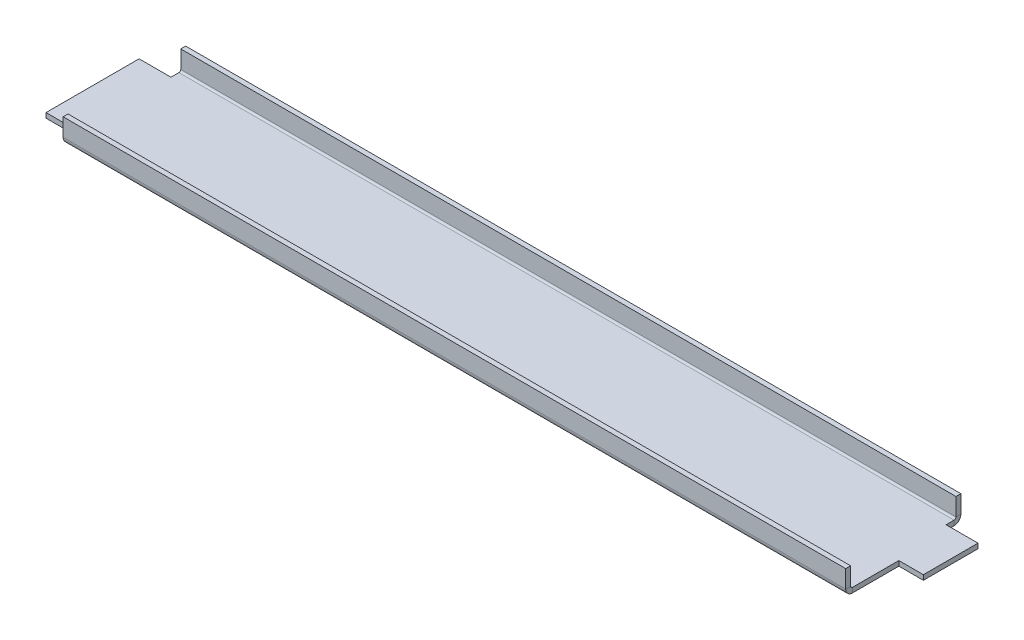
ISO-10303-21;
HEADER;
FILE_DESCRIPTION(('STEP AP214'),'2;1');
FILE_NAME('part.step','',(''),(''),'','','');
FILE_SCHEMA(('AUTOMOTIVE_DESIGN { 1 0 10303 214 1 1 1 1 }'));
ENDSEC;
DATA;
#1=APPLICATION_CONTEXT('core data for automotive mechanical design processes');
#2=APPLICATION_PROTOCOL_DEFINITION('international standard','automotive_design',2000,#1);
#3=PRODUCT_CONTEXT('',#1,'mechanical');
#4=PRODUCT('Part','Part','',(#3));
#5=PRODUCT_RELATED_PRODUCT_CATEGORY('part','',(#4));
#6=PRODUCT_DEFINITION_FORMATION('','',#4);
#7=PRODUCT_DEFINITION_CONTEXT('part definition',#1,'design');
#8=PRODUCT_DEFINITION('design','',#6,#7);
#9=PRODUCT_DEFINITION_SHAPE('','',#8);
#10=(LENGTH_UNIT() NAMED_UNIT(*) SI_UNIT(.MILLI.,.METRE.));
#11=(NAMED_UNIT(*) PLANE_ANGLE_UNIT() SI_UNIT($,.RADIAN.));
#12=(NAMED_UNIT(*) SI_UNIT($,.STERADIAN.) SOLID_ANGLE_UNIT());
#13=UNCERTAINTY_MEASURE_WITH_UNIT(LENGTH_MEASURE(1.E-05),#10,'distance_accuracy_value','');
#14=(GEOMETRIC_REPRESENTATION_CONTEXT(3) GLOBAL_UNCERTAINTY_ASSIGNED_CONTEXT((#13)) GLOBAL_UNIT_ASSIGNED_CONTEXT((#10,
#11,#12)) REPRESENTATION_CONTEXT('',''));
#15=CARTESIAN_POINT('',(0.,0.,0.));
#16=DIRECTION('',(0.,0.,1.));
#17=DIRECTION('',(1.,0.,0.));
#18=AXIS2_PLACEMENT_3D('',#15,#16,#17);
#19=CARTESIAN_POINT('',(161.2,0.,19.));
#20=DIRECTION('',(1.,0.,0.));
#21=DIRECTION('',(0.,0.,-1.));
#22=AXIS2_PLACEMENT_3D('',#19,#20,#21);
#23=PLANE('',#22);
#24=DIRECTION('',(0.,-1.,0.));
#25=VECTOR('',#24,1.);
#26=CARTESIAN_POINT('',(161.2,0.,25.));
#27=LINE('',#26,#25);
#28=CARTESIAN_POINT('',(161.2,10.,25.));
#29=VERTEX_POINT('',#28);
#30=CARTESIAN_POINT('',(161.2,2.7366,25.));
#31=VERTEX_POINT('',#30);
#32=EDGE_CURVE('E361',#29,#31,#27,.T.);
#33=ORIENTED_EDGE('',*,*,#32,.T.);
#34=DIRECTION('',(0.,0.,-1.));
#35=VECTOR('',#34,1.);
#36=CARTESIAN_POINT('',(161.2,2.7366,19.));
#37=LINE('',#36,#35);
#38=CARTESIAN_POINT('',(161.2,2.7366,23.));
#39=VERTEX_POINT('',#38);
#40=EDGE_CURVE('E14',#31,#39,#37,.T.);
#41=ORIENTED_EDGE('',*,*,#40,.T.);
#42=DIRECTION('',(0.,-1.,0.));
#43=VECTOR('',#42,1.);
#44=CARTESIAN_POINT('',(161.2,0.,23.));
#45=LINE('',#44,#43);
#46=CARTESIAN_POINT('',(161.2,10.,23.));
#47=VERTEX_POINT('',#46);
#48=EDGE_CURVE('E365',#47,#39,#45,.T.);
#49=ORIENTED_EDGE('',*,*,#48,.F.);
#50=DIRECTION('',(0.,0.,-1.));
#51=VECTOR('',#50,1.);
#52=CARTESIAN_POINT('',(161.2,10.,19.));
#53=LINE('',#52,#51);
#54=EDGE_CURVE('E366',#29,#47,#53,.T.);
#55=ORIENTED_EDGE('',*,*,#54,.F.);
#56=EDGE_LOOP('',(#33,#41,#49,#55));
#57=FACE_BOUND('',#56,.T.);
#58=ADVANCED_FACE('F105',(#57),#23,.T.);
#59=CARTESIAN_POINT('',(158.2,0.,-85.2858201534945));
#60=DIRECTION('',(1.,0.,0.));
#61=DIRECTION('',(0.,0.,-1.));
#62=AXIS2_PLACEMENT_3D('',#59,#60,#61);
#63=PLANE('',#62);
#64=DIRECTION('',(0.,0.,-1.));
#65=VECTOR('',#64,1.);
#66=CARTESIAN_POINT('',(158.2,0.,-85.2858201534945));
#67=LINE('',#66,#65);
#68=CARTESIAN_POINT('',(158.2,0.,-19.));
#69=VERTEX_POINT('',#68);
#70=CARTESIAN_POINT('',(158.2,0.,-22.2634));
#71=VERTEX_POINT('',#70);
#72=EDGE_CURVE('E370',#69,#71,#67,.T.);
#73=ORIENTED_EDGE('',*,*,#72,.T.);
#74=DIRECTION('',(0.,1.,0.));
#75=VECTOR('',#74,1.);
#76=CARTESIAN_POINT('',(158.2,0.,-22.2634));
#77=LINE('',#76,#75);
#78=CARTESIAN_POINT('',(158.2,1.99999999999999,-22.2634));
#79=VERTEX_POINT('',#78);
#80=EDGE_CURVE('E356',#71,#79,#77,.T.);
#81=ORIENTED_EDGE('',*,*,#80,.T.);
#82=DIRECTION('',(0.,0.,-1.));
#83=VECTOR('',#82,1.);
#84=CARTESIAN_POINT('',(158.2,2.,0.));
#85=LINE('',#84,#83);
#86=CARTESIAN_POINT('',(158.2,2.,-19.));
#87=VERTEX_POINT('',#86);
#88=EDGE_CURVE('E531',#87,#79,#85,.T.);
#89=ORIENTED_EDGE('',*,*,#88,.F.);
#90=DIRECTION('',(0.,1.,0.));
#91=VECTOR('',#90,1.);
#92=CARTESIAN_POINT('',(158.2,0.,-19.));
#93=LINE('',#92,#91);
#94=EDGE_CURVE('E544',#69,#87,#93,.T.);
#95=ORIENTED_EDGE('',*,*,#94,.F.);
#96=EDGE_LOOP('',(#73,#81,#89,#95));
#97=FACE_BOUND('',#96,.T.);
#98=ADVANCED_FACE('F553',(#97),#63,.T.);
#99=DIRECTION('',(0.,1.,0.));
#100=VECTOR('',#99,1.);
#101=CARTESIAN_POINT('',(158.2,0.,-23.));
#102=LINE('',#101,#100);
#103=CARTESIAN_POINT('',(158.2,2.73659999999999,-23.));
#104=VERTEX_POINT('',#103);
#105=CARTESIAN_POINT('',(158.2,10.0000000008471,-23.));
#106=VERTEX_POINT('',#105);
#107=EDGE_CURVE('E275',#104,#106,#102,.T.);
#108=ORIENTED_EDGE('',*,*,#107,.F.);
#109=DIRECTION('',(0.,0.,-1.));
#110=VECTOR('',#109,1.);
#111=CARTESIAN_POINT('',(158.2,2.73659999999999,-23.));
#112=LINE('',#111,#110);
#113=CARTESIAN_POINT('',(158.2,2.73659999999999,-25.));
#114=VERTEX_POINT('',#113);
#115=EDGE_CURVE('E353',#104,#114,#112,.T.);
#116=ORIENTED_EDGE('',*,*,#115,.T.);
#117=DIRECTION('',(0.,1.,0.));
#118=VECTOR('',#117,1.);
#119=CARTESIAN_POINT('',(158.2,0.,-25.));
#120=LINE('',#119,#118);
#121=CARTESIAN_POINT('',(158.2,10.,-25.));
#122=VERTEX_POINT('',#121);
#123=EDGE_CURVE('E124',#114,#122,#120,.T.);
#124=ORIENTED_EDGE('',*,*,#123,.T.);
#125=DIRECTION('',(0.,0.,1.));
#126=VECTOR('',#125,1.);
#127=CARTESIAN_POINT('',(158.2,10.,-25.));
#128=LINE('',#127,#126);
#129=EDGE_CURVE('E350',#122,#106,#128,.T.);
#130=ORIENTED_EDGE('',*,*,#129,.T.);
#131=EDGE_LOOP('',(#108,#116,#124,#130));
#132=FACE_BOUND('',#131,.T.);
#133=ADVANCED_FACE('F575',(#132),#63,.T.);
#134=CARTESIAN_POINT('',(161.2,0.,0.));
#135=DIRECTION('',(1.,0.,0.));
#136=DIRECTION('',(0.,0.,-1.));
#137=AXIS2_PLACEMENT_3D('',#134,#135,#136);
#138=PLANE('',#137);
#139=DIRECTION('',(0.,0.,-1.));
#140=VECTOR('',#139,1.);
#141=CARTESIAN_POINT('',(161.2,2.,0.));
#142=LINE('',#141,#140);
#143=CARTESIAN_POINT('',(161.2,2.,22.2634));
#144=VERTEX_POINT('',#143);
#145=CARTESIAN_POINT('',(161.2,2.,3.30000000012952));
#146=VERTEX_POINT('',#145);
#147=EDGE_CURVE('E468',#144,#146,#142,.T.);
#148=ORIENTED_EDGE('',*,*,#147,.F.);
#149=DIRECTION('',(0.,1.,0.));
#150=VECTOR('',#149,1.);
#151=CARTESIAN_POINT('',(161.2,0.,22.2634));
#152=LINE('',#151,#150);
#153=CARTESIAN_POINT('',(161.2,0.,22.2634));
#154=VERTEX_POINT('',#153);
#155=EDGE_CURVE('E115',#144,#154,#152,.F.);
#156=ORIENTED_EDGE('',*,*,#155,.T.);
#157=DIRECTION('',(0.,0.,-1.));
#158=VECTOR('',#157,1.);
#159=CARTESIAN_POINT('',(161.2,0.,0.));
#160=LINE('',#159,#158);
#161=CARTESIAN_POINT('',(161.2,0.,3.30000000012952));
#162=VERTEX_POINT('',#161);
#163=EDGE_CURVE('E151',#154,#162,#160,.T.);
#164=ORIENTED_EDGE('',*,*,#163,.T.);
#165=DIRECTION('',(0.,-1.,0.));
#166=VECTOR('',#165,1.);
#167=CARTESIAN_POINT('',(161.2,0.,3.30000000012952));
#168=LINE('',#167,#166);
#169=EDGE_CURVE('E463',#146,#162,#168,.T.);
#170=ORIENTED_EDGE('',*,*,#169,.F.);
#171=EDGE_LOOP('',(#148,#156,#164,#170));
#172=FACE_BOUND('',#171,.T.);
#173=ADVANCED_FACE('F484',(#172),#138,.T.);
#174=CARTESIAN_POINT('',(171.2,2.7366,22.2634));
#175=DIRECTION('',(1.,0.,0.));
#176=DIRECTION('',(0.,0.,1.));
#177=AXIS2_PLACEMENT_3D('',#174,#175,#176);
#178=CYLINDRICAL_SURFACE('',#177,2.7366);
#179=DIRECTION('',(1.,0.,0.));
#180=VECTOR('',#179,1.);
#181=CARTESIAN_POINT('',(171.2,0.,22.2634));
#182=LINE('',#181,#180);
#183=CARTESIAN_POINT('',(-158.2,0.,22.2634));
#184=VERTEX_POINT('',#183);
#185=EDGE_CURVE('E314',#154,#184,#182,.F.);
#186=ORIENTED_EDGE('',*,*,#185,.F.);
#187=CARTESIAN_POINT('',(161.2,2.7366,22.2634));
#188=DIRECTION('',(1.,0.,0.));
#189=DIRECTION('',(0.,0.,-1.));
#190=AXIS2_PLACEMENT_3D('',#187,#188,#189);
#191=CIRCLE('',#190,2.7366);
#192=EDGE_CURVE('E108',#154,#31,#191,.F.);
#193=ORIENTED_EDGE('',*,*,#192,.T.);
#194=DIRECTION('',(1.,0.,0.));
#195=VECTOR('',#194,1.);
#196=CARTESIAN_POINT('',(-171.2,2.7366,25.));
#197=LINE('',#196,#195);
#198=CARTESIAN_POINT('',(-158.2,2.7366,25.));
#199=VERTEX_POINT('',#198);
#200=EDGE_CURVE('E308',#31,#199,#197,.F.);
#201=ORIENTED_EDGE('',*,*,#200,.T.);
#202=CARTESIAN_POINT('',(-158.2,2.7366,22.2634));
#203=DIRECTION('',(1.,0.,0.));
#204=DIRECTION('',(0.,0.,-1.));
#205=AXIS2_PLACEMENT_3D('',#202,#203,#204);
#206=CIRCLE('',#205,2.7366);
#207=EDGE_CURVE('E445',#184,#199,#206,.F.);
#208=ORIENTED_EDGE('',*,*,#207,.F.);
#209=EDGE_LOOP('',(#186,#193,#201,#208));
#210=FACE_BOUND('',#209,.T.);
#211=ADVANCED_FACE('F493',(#210),#178,.T.);
#212=CARTESIAN_POINT('',(171.2,2.7366,22.2634));
#213=DIRECTION('',(1.,0.,0.));
#214=DIRECTION('',(0.,0.,1.));
#215=AXIS2_PLACEMENT_3D('',#212,#213,#214);
#216=CYLINDRICAL_SURFACE('',#215,0.7366);
#217=CARTESIAN_POINT('',(161.2,2.7366,22.2634));
#218=DIRECTION('',(1.,0.,0.));
#219=DIRECTION('',(0.,0.,-1.));
#220=AXIS2_PLACEMENT_3D('',#217,#218,#219);
#221=CIRCLE('',#220,0.7366);
#222=EDGE_CURVE('E373',#144,#39,#221,.F.);
#223=ORIENTED_EDGE('',*,*,#222,.F.);
#224=DIRECTION('',(1.,0.,0.));
#225=VECTOR('',#224,1.);
#226=CARTESIAN_POINT('',(171.2,2.,22.2634));
#227=LINE('',#226,#225);
#228=CARTESIAN_POINT('',(-158.2,2.,22.2634));
#229=VERTEX_POINT('',#228);
#230=EDGE_CURVE('E304',#144,#229,#227,.F.);
#231=ORIENTED_EDGE('',*,*,#230,.T.);
#232=CARTESIAN_POINT('',(-158.2,2.7366,22.2634));
#233=DIRECTION('',(1.,0.,0.));
#234=DIRECTION('',(0.,0.,-1.));
#235=AXIS2_PLACEMENT_3D('',#232,#233,#234);
#236=CIRCLE('',#235,0.7366);
#237=CARTESIAN_POINT('',(-158.2,2.7366,23.));
#238=VERTEX_POINT('',#237);
#239=EDGE_CURVE('E433',#229,#238,#236,.F.);
#240=ORIENTED_EDGE('',*,*,#239,.T.);
#241=DIRECTION('',(1.,0.,0.));
#242=VECTOR('',#241,1.);
#243=CARTESIAN_POINT('',(-171.2,2.7366,23.));
#244=LINE('',#243,#242);
#245=EDGE_CURVE('E297',#238,#39,#244,.T.);
#246=ORIENTED_EDGE('',*,*,#245,.T.);
#247=EDGE_LOOP('',(#223,#231,#240,#246));
#248=FACE_BOUND('',#247,.T.);
#249=ADVANCED_FACE('F617',(#248),#216,.F.);
#250=CARTESIAN_POINT('',(0.,0.,25.));
#251=DIRECTION('',(0.,0.,-1.));
#252=DIRECTION('',(-1.,0.,0.));
#253=AXIS2_PLACEMENT_3D('',#250,#251,#252);
#254=PLANE('',#253);
#255=ORIENTED_EDGE('',*,*,#32,.F.);
#256=DIRECTION('',(-1.,0.,0.));
#257=VECTOR('',#256,1.);
#258=CARTESIAN_POINT('',(0.,10.,25.));
#259=LINE('',#258,#257);
#260=CARTESIAN_POINT('',(-158.2,10.0000000008471,25.));
#261=VERTEX_POINT('',#260);
#262=EDGE_CURVE('E301',#29,#261,#259,.T.);
#263=ORIENTED_EDGE('',*,*,#262,.T.);
#264=DIRECTION('',(0.,-1.,0.));
#265=VECTOR('',#264,1.);
#266=CARTESIAN_POINT('',(-158.2,0.,25.));
#267=LINE('',#266,#265);
#268=EDGE_CURVE('E441',#261,#199,#267,.T.);
#269=ORIENTED_EDGE('',*,*,#268,.T.);
#270=ORIENTED_EDGE('',*,*,#200,.F.);
#271=EDGE_LOOP('',(#255,#263,#269,#270));
#272=FACE_BOUND('',#271,.T.);
#273=ADVANCED_FACE('F624',(#272),#254,.F.);
#274=CARTESIAN_POINT('',(0.,0.,23.));
#275=DIRECTION('',(0.,0.,-1.));
#276=DIRECTION('',(-1.,0.,0.));
#277=AXIS2_PLACEMENT_3D('',#274,#275,#276);
#278=PLANE('',#277);
#279=DIRECTION('',(1.,0.,0.));
#280=VECTOR('',#279,1.);
#281=CARTESIAN_POINT('',(-171.2,10.,23.));
#282=LINE('',#281,#280);
#283=CARTESIAN_POINT('',(-158.2,10.0000000008471,23.));
#284=VERTEX_POINT('',#283);
#285=EDGE_CURVE('E305',#47,#284,#282,.F.);
#286=ORIENTED_EDGE('',*,*,#285,.F.);
#287=ORIENTED_EDGE('',*,*,#48,.T.);
#288=ORIENTED_EDGE('',*,*,#245,.F.);
#289=DIRECTION('',(0.,-1.,0.));
#290=VECTOR('',#289,1.);
#291=CARTESIAN_POINT('',(-158.2,0.,23.));
#292=LINE('',#291,#290);
#293=EDGE_CURVE('E437',#284,#238,#292,.T.);
#294=ORIENTED_EDGE('',*,*,#293,.F.);
#295=EDGE_LOOP('',(#286,#287,#288,#294));
#296=FACE_BOUND('',#295,.T.);
#297=ADVANCED_FACE('F618',(#296),#278,.T.);
#298=CARTESIAN_POINT('',(-171.2,10.,25.));
#299=DIRECTION('',(0.,-1.,0.));
#300=DIRECTION('',(0.,0.,-1.));
#301=AXIS2_PLACEMENT_3D('',#298,#299,#300);
#302=PLANE('',#301);
#303=ORIENTED_EDGE('',*,*,#54,.T.);
#304=ORIENTED_EDGE('',*,*,#285,.T.);
#305=DIRECTION('',(0.,0.,-1.));
#306=VECTOR('',#305,1.);
#307=CARTESIAN_POINT('',(-158.2,10.0000000008471,19.));
#308=LINE('',#307,#306);
#309=EDGE_CURVE('E391',#261,#284,#308,.T.);
#310=ORIENTED_EDGE('',*,*,#309,.F.);
#311=ORIENTED_EDGE('',*,*,#262,.F.);
#312=EDGE_LOOP('',(#303,#304,#310,#311));
#313=FACE_BOUND('',#312,.T.);
#314=ADVANCED_FACE('F622',(#313),#302,.F.);
#315=CARTESIAN_POINT('',(171.2,2.,-25.));
#316=DIRECTION('',(-1.,0.,0.));
#317=DIRECTION('',(0.,0.,1.));
#318=AXIS2_PLACEMENT_3D('',#315,#316,#317);
#319=PLANE('',#318);
#320=DIRECTION('',(0.,-1.,0.));
#321=VECTOR('',#320,1.);
#322=CARTESIAN_POINT('',(171.2,2.,-19.));
#323=LINE('',#322,#321);
#324=CARTESIAN_POINT('',(171.2,2.,-19.));
#325=VERTEX_POINT('',#324);
#326=CARTESIAN_POINT('',(171.2,0.,-19.));
#327=VERTEX_POINT('',#326);
#328=EDGE_CURVE('E376',#325,#327,#323,.T.);
#329=ORIENTED_EDGE('',*,*,#328,.F.);
#330=DIRECTION('',(0.,0.,-1.));
#331=VECTOR('',#330,1.);
#332=CARTESIAN_POINT('',(171.2,2.,-25.));
#333=LINE('',#332,#331);
#334=CARTESIAN_POINT('',(171.2,2.,3.30000000012952));
#335=VERTEX_POINT('',#334);
#336=EDGE_CURVE('E320',#335,#325,#333,.T.);
#337=ORIENTED_EDGE('',*,*,#336,.F.);
#338=DIRECTION('',(0.,-1.,0.));
#339=VECTOR('',#338,1.);
#340=CARTESIAN_POINT('',(171.2,0.,3.30000000012952));
#341=LINE('',#340,#339);
#342=CARTESIAN_POINT('',(171.2,0.,3.30000000012952));
#343=VERTEX_POINT('',#342);
#344=EDGE_CURVE('E464',#335,#343,#341,.T.);
#345=ORIENTED_EDGE('',*,*,#344,.T.);
#346=DIRECTION('',(0.,0.,-1.));
#347=VECTOR('',#346,1.);
#348=CARTESIAN_POINT('',(171.2,0.,-25.));
#349=LINE('',#348,#347);
#350=EDGE_CURVE('E317',#343,#327,#349,.T.);
#351=ORIENTED_EDGE('',*,*,#350,.T.);
#352=EDGE_LOOP('',(#329,#337,#345,#351));
#353=FACE_BOUND('',#352,.T.);
#354=ADVANCED_FACE('F635',(#353),#319,.F.);
#355=CARTESIAN_POINT('',(0.,2.,0.));
#356=DIRECTION('',(0.,1.,0.));
#357=DIRECTION('',(0.,0.,1.));
#358=AXIS2_PLACEMENT_3D('',#355,#356,#357);
#359=PLANE('',#358);
#360=ORIENTED_EDGE('',*,*,#230,.F.);
#361=ORIENTED_EDGE('',*,*,#147,.T.);
#362=DIRECTION('',(-1.,0.,0.));
#363=VECTOR('',#362,1.);
#364=CARTESIAN_POINT('',(0.,2.,3.30000000012952));
#365=LINE('',#364,#363);
#366=EDGE_CURVE('E292',#335,#146,#365,.T.);
#367=ORIENTED_EDGE('',*,*,#366,.F.);
#368=ORIENTED_EDGE('',*,*,#336,.T.);
#369=DIRECTION('',(-1.,0.,0.));
#370=VECTOR('',#369,1.);
#371=CARTESIAN_POINT('',(0.,2.,-19.0000000000001));
#372=LINE('',#371,#370);
#373=EDGE_CURVE('E382',#325,#87,#372,.T.);
#374=ORIENTED_EDGE('',*,*,#373,.T.);
#375=ORIENTED_EDGE('',*,*,#88,.T.);
#376=DIRECTION('',(-1.,0.,0.));
#377=VECTOR('',#376,1.);
#378=CARTESIAN_POINT('',(-171.2,1.99999999999999,-22.2634));
#379=LINE('',#378,#377);
#380=CARTESIAN_POINT('',(-158.2,1.99999999999999,-22.2634));
#381=VERTEX_POINT('',#380);
#382=EDGE_CURVE('E282',#381,#79,#379,.F.);
#383=ORIENTED_EDGE('',*,*,#382,.F.);
#384=DIRECTION('',(0.,0.,-1.));
#385=VECTOR('',#384,1.);
#386=CARTESIAN_POINT('',(-158.2,2.,0.));
#387=LINE('',#386,#385);
#388=CARTESIAN_POINT('',(-158.2,2.,-19.));
#389=VERTEX_POINT('',#388);
#390=EDGE_CURVE('E420',#389,#381,#387,.T.);
#391=ORIENTED_EDGE('',*,*,#390,.F.);
#392=DIRECTION('',(1.,0.,0.));
#393=VECTOR('',#392,1.);
#394=CARTESIAN_POINT('',(0.,2.,-19.0000000000001));
#395=LINE('',#394,#393);
#396=CARTESIAN_POINT('',(-171.2,2.,-19.));
#397=VERTEX_POINT('',#396);
#398=EDGE_CURVE('E456',#397,#389,#395,.T.);
#399=ORIENTED_EDGE('',*,*,#398,.F.);
#400=DIRECTION('',(0.,0.,1.));
#401=VECTOR('',#400,1.);
#402=CARTESIAN_POINT('',(-171.2,2.,-25.));
#403=LINE('',#402,#401);
#404=CARTESIAN_POINT('',(-171.2,2.,19.));
#405=VERTEX_POINT('',#404);
#406=EDGE_CURVE('E324',#397,#405,#403,.T.);
#407=ORIENTED_EDGE('',*,*,#406,.T.);
#408=DIRECTION('',(-1.,0.,0.));
#409=VECTOR('',#408,1.);
#410=CARTESIAN_POINT('',(0.,2.,19.));
#411=LINE('',#410,#409);
#412=CARTESIAN_POINT('',(-158.2,2.,19.));
#413=VERTEX_POINT('',#412);
#414=EDGE_CURVE('E449',#413,#405,#411,.T.);
#415=ORIENTED_EDGE('',*,*,#414,.F.);
#416=DIRECTION('',(0.,0.,-1.));
#417=VECTOR('',#416,1.);
#418=CARTESIAN_POINT('',(-158.2,2.,0.));
#419=LINE('',#418,#417);
#420=EDGE_CURVE('E430',#229,#413,#419,.T.);
#421=ORIENTED_EDGE('',*,*,#420,.F.);
#422=EDGE_LOOP('',(#360,#361,#367,#368,#374,#375,#383,#391,#399,#407,#415,#421));
#423=FACE_BOUND('',#422,.T.);
#424=ADVANCED_FACE('F508',(#423),#359,.T.);
#425=CARTESIAN_POINT('',(0.,0.,0.));
#426=DIRECTION('',(0.,1.,0.));
#427=DIRECTION('',(0.,0.,1.));
#428=AXIS2_PLACEMENT_3D('',#425,#426,#427);
#429=PLANE('',#428);
#430=ORIENTED_EDGE('',*,*,#163,.F.);
#431=ORIENTED_EDGE('',*,*,#185,.T.);
#432=DIRECTION('',(0.,0.,-1.));
#433=VECTOR('',#432,1.);
#434=CARTESIAN_POINT('',(-158.2,0.,19.));
#435=LINE('',#434,#433);
#436=CARTESIAN_POINT('',(-158.2,0.,19.));
#437=VERTEX_POINT('',#436);
#438=EDGE_CURVE('E395',#184,#437,#435,.T.);
#439=ORIENTED_EDGE('',*,*,#438,.T.);
#440=DIRECTION('',(-1.,0.,0.));
#441=VECTOR('',#440,1.);
#442=CARTESIAN_POINT('',(-158.2,0.,19.));
#443=LINE('',#442,#441);
#444=CARTESIAN_POINT('',(-171.2,0.,19.));
#445=VERTEX_POINT('',#444);
#446=EDGE_CURVE('E399',#437,#445,#443,.T.);
#447=ORIENTED_EDGE('',*,*,#446,.T.);
#448=DIRECTION('',(0.,0.,1.));
#449=VECTOR('',#448,1.);
#450=CARTESIAN_POINT('',(-171.2,0.,-25.));
#451=LINE('',#450,#449);
#452=CARTESIAN_POINT('',(-171.2,0.,-19.));
#453=VERTEX_POINT('',#452);
#454=EDGE_CURVE('E325',#453,#445,#451,.T.);
#455=ORIENTED_EDGE('',*,*,#454,.F.);
#456=DIRECTION('',(1.,0.,0.));
#457=VECTOR('',#456,1.);
#458=CARTESIAN_POINT('',(-158.2,0.,-19.));
#459=LINE('',#458,#457);
#460=CARTESIAN_POINT('',(-158.2,0.,-19.));
#461=VERTEX_POINT('',#460);
#462=EDGE_CURVE('E403',#453,#461,#459,.T.);
#463=ORIENTED_EDGE('',*,*,#462,.T.);
#464=DIRECTION('',(0.,0.,-1.));
#465=VECTOR('',#464,1.);
#466=CARTESIAN_POINT('',(-158.2,0.,-85.2858201534945));
#467=LINE('',#466,#465);
#468=CARTESIAN_POINT('',(-158.2,0.,-22.2634));
#469=VERTEX_POINT('',#468);
#470=EDGE_CURVE('E407',#461,#469,#467,.T.);
#471=ORIENTED_EDGE('',*,*,#470,.T.);
#472=DIRECTION('',(-1.,0.,0.));
#473=VECTOR('',#472,1.);
#474=CARTESIAN_POINT('',(-171.2,0.,-22.2634));
#475=LINE('',#474,#473);
#476=EDGE_CURVE('E293',#469,#71,#475,.F.);
#477=ORIENTED_EDGE('',*,*,#476,.T.);
#478=ORIENTED_EDGE('',*,*,#72,.F.);
#479=DIRECTION('',(-1.,0.,0.));
#480=VECTOR('',#479,1.);
#481=CARTESIAN_POINT('',(158.2,0.,-19.));
#482=LINE('',#481,#480);
#483=EDGE_CURVE('E161',#327,#69,#482,.T.);
#484=ORIENTED_EDGE('',*,*,#483,.F.);
#485=ORIENTED_EDGE('',*,*,#350,.F.);
#486=DIRECTION('',(-1.,0.,0.));
#487=VECTOR('',#486,1.);
#488=CARTESIAN_POINT('',(0.,0.,3.30000000012952));
#489=LINE('',#488,#487);
#490=EDGE_CURVE('E270',#343,#162,#489,.T.);
#491=ORIENTED_EDGE('',*,*,#490,.T.);
#492=EDGE_LOOP('',(#430,#431,#439,#447,#455,#463,#471,#477,#478,#484,#485,#491));
#493=FACE_BOUND('',#492,.T.);
#494=ADVANCED_FACE('F495',(#493),#429,.F.);
#495=CARTESIAN_POINT('',(-171.2,2.7366,-22.2634));
#496=DIRECTION('',(-1.,0.,0.));
#497=DIRECTION('',(0.,0.,-1.));
#498=AXIS2_PLACEMENT_3D('',#495,#496,#497);
#499=CYLINDRICAL_SURFACE('',#498,2.7366);
#500=DIRECTION('',(-1.,0.,0.));
#501=VECTOR('',#500,1.);
#502=CARTESIAN_POINT('',(171.2,2.73660000000001,-25.));
#503=LINE('',#502,#501);
#504=CARTESIAN_POINT('',(-158.2,2.73659999999999,-25.));
#505=VERTEX_POINT('',#504);
#506=EDGE_CURVE('E277',#505,#114,#503,.F.);
#507=ORIENTED_EDGE('',*,*,#506,.T.);
#508=CARTESIAN_POINT('',(158.2,2.7366,-22.2634));
#509=DIRECTION('',(1.,0.,0.));
#510=DIRECTION('',(0.,0.,-1.));
#511=AXIS2_PLACEMENT_3D('',#508,#509,#510);
#512=CIRCLE('',#511,2.7366);
#513=EDGE_CURVE('E387',#114,#71,#512,.F.);
#514=ORIENTED_EDGE('',*,*,#513,.T.);
#515=ORIENTED_EDGE('',*,*,#476,.F.);
#516=CARTESIAN_POINT('',(-158.2,2.7366,-22.2634));
#517=DIRECTION('',(1.,0.,0.));
#518=DIRECTION('',(0.,0.,-1.));
#519=AXIS2_PLACEMENT_3D('',#516,#517,#518);
#520=CIRCLE('',#519,2.7366);
#521=EDGE_CURVE('E426',#505,#469,#520,.F.);
#522=ORIENTED_EDGE('',*,*,#521,.F.);
#523=EDGE_LOOP('',(#507,#514,#515,#522));
#524=FACE_BOUND('',#523,.T.);
#525=ADVANCED_FACE('F526',(#524),#499,.T.);
#526=CARTESIAN_POINT('',(-171.2,2.7366,-22.2634));
#527=DIRECTION('',(-1.,0.,0.));
#528=DIRECTION('',(0.,0.,-1.));
#529=AXIS2_PLACEMENT_3D('',#526,#527,#528);
#530=CYLINDRICAL_SURFACE('',#529,0.7366);
#531=CARTESIAN_POINT('',(158.2,2.7366,-22.2634));
#532=DIRECTION('',(1.,0.,0.));
#533=DIRECTION('',(0.,0.,-1.));
#534=AXIS2_PLACEMENT_3D('',#531,#532,#533);
#535=CIRCLE('',#534,0.7366);
#536=EDGE_CURVE('E536',#104,#79,#535,.F.);
#537=ORIENTED_EDGE('',*,*,#536,.F.);
#538=DIRECTION('',(-1.,0.,0.));
#539=VECTOR('',#538,1.);
#540=CARTESIAN_POINT('',(171.2,2.7366,-23.));
#541=LINE('',#540,#539);
#542=CARTESIAN_POINT('',(-158.2,2.73659999999999,-23.));
#543=VERTEX_POINT('',#542);
#544=EDGE_CURVE('E286',#104,#543,#541,.T.);
#545=ORIENTED_EDGE('',*,*,#544,.T.);
#546=CARTESIAN_POINT('',(-158.2,2.7366,-22.2634));
#547=DIRECTION('',(1.,0.,0.));
#548=DIRECTION('',(0.,0.,-1.));
#549=AXIS2_PLACEMENT_3D('',#546,#547,#548);
#550=CIRCLE('',#549,0.7366);
#551=EDGE_CURVE('E259',#543,#381,#550,.F.);
#552=ORIENTED_EDGE('',*,*,#551,.T.);
#553=ORIENTED_EDGE('',*,*,#382,.T.);
#554=EDGE_LOOP('',(#537,#545,#552,#553));
#555=FACE_BOUND('',#554,.T.);
#556=ADVANCED_FACE('F560',(#555),#530,.F.);
#557=CARTESIAN_POINT('',(0.,0.,-25.));
#558=DIRECTION('',(0.,0.,1.));
#559=DIRECTION('',(0.,-1.,0.));
#560=AXIS2_PLACEMENT_3D('',#557,#558,#559);
#561=PLANE('',#560);
#562=ORIENTED_EDGE('',*,*,#123,.F.);
#563=ORIENTED_EDGE('',*,*,#506,.F.);
#564=DIRECTION('',(0.,1.,0.));
#565=VECTOR('',#564,1.);
#566=CARTESIAN_POINT('',(-158.2,0.,-25.));
#567=LINE('',#566,#565);
#568=CARTESIAN_POINT('',(-158.2,10.0000000008471,-25.));
#569=VERTEX_POINT('',#568);
#570=EDGE_CURVE('E423',#505,#569,#567,.T.);
#571=ORIENTED_EDGE('',*,*,#570,.T.);
#572=DIRECTION('',(1.,0.,0.));
#573=VECTOR('',#572,1.);
#574=CARTESIAN_POINT('',(0.,10.,-25.));
#575=LINE('',#574,#573);
#576=EDGE_CURVE('E268',#569,#122,#575,.T.);
#577=ORIENTED_EDGE('',*,*,#576,.T.);
#578=EDGE_LOOP('',(#562,#563,#571,#577));
#579=FACE_BOUND('',#578,.T.);
#580=ADVANCED_FACE('F529',(#579),#561,.F.);
#581=CARTESIAN_POINT('',(0.,0.,-23.));
#582=DIRECTION('',(0.,0.,1.));
#583=DIRECTION('',(0.,-1.,0.));
#584=AXIS2_PLACEMENT_3D('',#581,#582,#583);
#585=PLANE('',#584);
#586=ORIENTED_EDGE('',*,*,#544,.F.);
#587=ORIENTED_EDGE('',*,*,#107,.T.);
#588=DIRECTION('',(-1.,0.,0.));
#589=VECTOR('',#588,1.);
#590=CARTESIAN_POINT('',(171.2,10.,-23.));
#591=LINE('',#590,#589);
#592=CARTESIAN_POINT('',(-158.2,10.,-23.));
#593=VERTEX_POINT('',#592);
#594=EDGE_CURVE('E266',#593,#106,#591,.F.);
#595=ORIENTED_EDGE('',*,*,#594,.F.);
#596=DIRECTION('',(0.,1.,0.));
#597=VECTOR('',#596,1.);
#598=CARTESIAN_POINT('',(-158.2,0.,-23.));
#599=LINE('',#598,#597);
#600=EDGE_CURVE('E247',#543,#593,#599,.T.);
#601=ORIENTED_EDGE('',*,*,#600,.F.);
#602=EDGE_LOOP('',(#586,#587,#595,#601));
#603=FACE_BOUND('',#602,.T.);
#604=ADVANCED_FACE('F273',(#603),#585,.T.);
#605=CARTESIAN_POINT('',(171.2,10.,-25.));
#606=DIRECTION('',(0.,-1.,0.));
#607=DIRECTION('',(0.,0.,-1.));
#608=AXIS2_PLACEMENT_3D('',#605,#606,#607);
#609=PLANE('',#608);
#610=ORIENTED_EDGE('',*,*,#129,.F.);
#611=ORIENTED_EDGE('',*,*,#576,.F.);
#612=DIRECTION('',(0.,0.,1.));
#613=VECTOR('',#612,1.);
#614=CARTESIAN_POINT('',(-158.2,10.,-25.));
#615=LINE('',#614,#613);
#616=EDGE_CURVE('E251',#569,#593,#615,.T.);
#617=ORIENTED_EDGE('',*,*,#616,.T.);
#618=ORIENTED_EDGE('',*,*,#594,.T.);
#619=EDGE_LOOP('',(#610,#611,#617,#618));
#620=FACE_BOUND('',#619,.T.);
#621=ADVANCED_FACE('F265',(#620),#609,.F.);
#622=CARTESIAN_POINT('',(-158.2,0.,19.));
#623=DIRECTION('',(1.,0.,0.));
#624=DIRECTION('',(0.,0.,-1.));
#625=AXIS2_PLACEMENT_3D('',#622,#623,#624);
#626=PLANE('',#625);
#627=ORIENTED_EDGE('',*,*,#293,.T.);
#628=DIRECTION('',(0.,0.,1.));
#629=VECTOR('',#628,1.);
#630=CARTESIAN_POINT('',(-158.2,2.7366,23.));
#631=LINE('',#630,#629);
#632=EDGE_CURVE('E346',#238,#199,#631,.T.);
#633=ORIENTED_EDGE('',*,*,#632,.T.);
#634=ORIENTED_EDGE('',*,*,#268,.F.);
#635=ORIENTED_EDGE('',*,*,#309,.T.);
#636=EDGE_LOOP('',(#627,#633,#634,#635));
#637=FACE_BOUND('',#636,.T.);
#638=ADVANCED_FACE('F595',(#637),#626,.F.);
#639=ORIENTED_EDGE('',*,*,#438,.F.);
#640=DIRECTION('',(0.,1.,0.));
#641=VECTOR('',#640,1.);
#642=CARTESIAN_POINT('',(-158.2,0.,22.2634));
#643=LINE('',#642,#641);
#644=EDGE_CURVE('E342',#184,#229,#643,.T.);
#645=ORIENTED_EDGE('',*,*,#644,.T.);
#646=ORIENTED_EDGE('',*,*,#420,.T.);
#647=DIRECTION('',(0.,1.,0.));
#648=VECTOR('',#647,1.);
#649=CARTESIAN_POINT('',(-158.2,0.,19.));
#650=LINE('',#649,#648);
#651=EDGE_CURVE('E411',#437,#413,#650,.T.);
#652=ORIENTED_EDGE('',*,*,#651,.F.);
#653=EDGE_LOOP('',(#639,#645,#646,#652));
#654=FACE_BOUND('',#653,.T.);
#655=ADVANCED_FACE('F503',(#654),#626,.F.);
#656=CARTESIAN_POINT('',(-158.2,0.,-85.2858201534945));
#657=DIRECTION('',(1.,0.,0.));
#658=DIRECTION('',(0.,0.,-1.));
#659=AXIS2_PLACEMENT_3D('',#656,#657,#658);
#660=PLANE('',#659);
#661=ORIENTED_EDGE('',*,*,#390,.T.);
#662=DIRECTION('',(0.,-1.,0.));
#663=VECTOR('',#662,1.);
#664=CARTESIAN_POINT('',(-158.2,1.99999999999999,-22.2634));
#665=LINE('',#664,#663);
#666=EDGE_CURVE('E339',#381,#469,#665,.T.);
#667=ORIENTED_EDGE('',*,*,#666,.T.);
#668=ORIENTED_EDGE('',*,*,#470,.F.);
#669=DIRECTION('',(0.,1.,0.));
#670=VECTOR('',#669,1.);
#671=CARTESIAN_POINT('',(-158.2,0.,-19.));
#672=LINE('',#671,#670);
#673=EDGE_CURVE('E260',#461,#389,#672,.T.);
#674=ORIENTED_EDGE('',*,*,#673,.T.);
#675=EDGE_LOOP('',(#661,#667,#668,#674));
#676=FACE_BOUND('',#675,.T.);
#677=ADVANCED_FACE('F520',(#676),#660,.F.);
#678=ORIENTED_EDGE('',*,*,#570,.F.);
#679=DIRECTION('',(0.,0.,1.));
#680=VECTOR('',#679,1.);
#681=CARTESIAN_POINT('',(-158.2,2.73659999999999,-25.));
#682=LINE('',#681,#680);
#683=EDGE_CURVE('E253',#505,#543,#682,.T.);
#684=ORIENTED_EDGE('',*,*,#683,.T.);
#685=ORIENTED_EDGE('',*,*,#600,.T.);
#686=ORIENTED_EDGE('',*,*,#616,.F.);
#687=EDGE_LOOP('',(#678,#684,#685,#686));
#688=FACE_BOUND('',#687,.T.);
#689=ADVANCED_FACE('F250',(#688),#660,.F.);
#690=CARTESIAN_POINT('',(-171.2,2.,-25.));
#691=DIRECTION('',(1.,0.,0.));
#692=DIRECTION('',(0.,0.,-1.));
#693=AXIS2_PLACEMENT_3D('',#690,#691,#692);
#694=PLANE('',#693);
#695=ORIENTED_EDGE('',*,*,#406,.F.);
#696=DIRECTION('',(0.,-1.,0.));
#697=VECTOR('',#696,1.);
#698=CARTESIAN_POINT('',(-171.2,2.,-19.));
#699=LINE('',#698,#697);
#700=EDGE_CURVE('E459',#397,#453,#699,.T.);
#701=ORIENTED_EDGE('',*,*,#700,.T.);
#702=ORIENTED_EDGE('',*,*,#454,.T.);
#703=DIRECTION('',(0.,1.,0.));
#704=VECTOR('',#703,1.);
#705=CARTESIAN_POINT('',(-171.2,2.,19.));
#706=LINE('',#705,#704);
#707=EDGE_CURVE('E452',#445,#405,#706,.T.);
#708=ORIENTED_EDGE('',*,*,#707,.T.);
#709=EDGE_LOOP('',(#695,#701,#702,#708));
#710=FACE_BOUND('',#709,.T.);
#711=ADVANCED_FACE('F513',(#710),#694,.F.);
#712=CARTESIAN_POINT('',(171.2,0.,3.30000000012952));
#713=DIRECTION('',(0.,0.,-1.));
#714=DIRECTION('',(-1.,0.,0.));
#715=AXIS2_PLACEMENT_3D('',#712,#713,#714);
#716=PLANE('',#715);
#717=ORIENTED_EDGE('',*,*,#366,.T.);
#718=ORIENTED_EDGE('',*,*,#169,.T.);
#719=ORIENTED_EDGE('',*,*,#490,.F.);
#720=ORIENTED_EDGE('',*,*,#344,.F.);
#721=EDGE_LOOP('',(#717,#718,#719,#720));
#722=FACE_BOUND('',#721,.T.);
#723=ADVANCED_FACE('F480',(#722),#716,.F.);
#724=ORIENTED_EDGE('',*,*,#666,.F.);
#725=ORIENTED_EDGE('',*,*,#551,.F.);
#726=ORIENTED_EDGE('',*,*,#683,.F.);
#727=ORIENTED_EDGE('',*,*,#521,.T.);
#728=EDGE_LOOP('',(#724,#725,#726,#727));
#729=FACE_BOUND('',#728,.T.);
#730=ADVANCED_FACE('F523',(#729),#660,.F.);
#731=CARTESIAN_POINT('',(-158.2,0.,-19.));
#732=DIRECTION('',(0.,0.,1.));
#733=DIRECTION('',(1.,0.,0.));
#734=AXIS2_PLACEMENT_3D('',#731,#732,#733);
#735=PLANE('',#734);
#736=ORIENTED_EDGE('',*,*,#398,.T.);
#737=ORIENTED_EDGE('',*,*,#673,.F.);
#738=ORIENTED_EDGE('',*,*,#462,.F.);
#739=ORIENTED_EDGE('',*,*,#700,.F.);
#740=EDGE_LOOP('',(#736,#737,#738,#739));
#741=FACE_BOUND('',#740,.T.);
#742=ADVANCED_FACE('F518',(#741),#735,.F.);
#743=CARTESIAN_POINT('',(-158.2,0.,19.));
#744=DIRECTION('',(0.,0.,-1.));
#745=DIRECTION('',(-1.,0.,0.));
#746=AXIS2_PLACEMENT_3D('',#743,#744,#745);
#747=PLANE('',#746);
#748=ORIENTED_EDGE('',*,*,#446,.F.);
#749=ORIENTED_EDGE('',*,*,#651,.T.);
#750=ORIENTED_EDGE('',*,*,#414,.T.);
#751=ORIENTED_EDGE('',*,*,#707,.F.);
#752=EDGE_LOOP('',(#748,#749,#750,#751));
#753=FACE_BOUND('',#752,.T.);
#754=ADVANCED_FACE('F506',(#753),#747,.F.);
#755=ORIENTED_EDGE('',*,*,#632,.F.);
#756=ORIENTED_EDGE('',*,*,#239,.F.);
#757=ORIENTED_EDGE('',*,*,#644,.F.);
#758=ORIENTED_EDGE('',*,*,#207,.T.);
#759=EDGE_LOOP('',(#755,#756,#757,#758));
#760=FACE_BOUND('',#759,.T.);
#761=ADVANCED_FACE('F499',(#760),#626,.F.);
#762=ORIENTED_EDGE('',*,*,#80,.F.);
#763=ORIENTED_EDGE('',*,*,#513,.F.);
#764=ORIENTED_EDGE('',*,*,#115,.F.);
#765=ORIENTED_EDGE('',*,*,#536,.T.);
#766=EDGE_LOOP('',(#762,#763,#764,#765));
#767=FACE_BOUND('',#766,.T.);
#768=ADVANCED_FACE('F556',(#767),#63,.T.);
#769=CARTESIAN_POINT('',(158.2,0.,-19.));
#770=DIRECTION('',(0.,0.,-1.));
#771=DIRECTION('',(-1.,0.,0.));
#772=AXIS2_PLACEMENT_3D('',#769,#770,#771);
#773=PLANE('',#772);
#774=ORIENTED_EDGE('',*,*,#328,.T.);
#775=ORIENTED_EDGE('',*,*,#483,.T.);
#776=ORIENTED_EDGE('',*,*,#94,.T.);
#777=ORIENTED_EDGE('',*,*,#373,.F.);
#778=EDGE_LOOP('',(#774,#775,#776,#777));
#779=FACE_BOUND('',#778,.T.);
#780=ADVANCED_FACE('F578',(#779),#773,.T.);
#781=ORIENTED_EDGE('',*,*,#40,.F.);
#782=ORIENTED_EDGE('',*,*,#192,.F.);
#783=ORIENTED_EDGE('',*,*,#155,.F.);
#784=ORIENTED_EDGE('',*,*,#222,.T.);
#785=EDGE_LOOP('',(#781,#782,#783,#784));
#786=FACE_BOUND('',#785,.T.);
#787=ADVANCED_FACE('F488',(#786),#23,.T.);
#788=CLOSED_SHELL('',(#58,#98,#133,#173,#211,#249,#273,#297,#314,#354,#424,#494,#525,#556,#580,
#604,#621,#638,#655,#677,#689,#711,#723,#730,#742,#754,#761,#768,#780,#787));
#789=MANIFOLD_SOLID_BREP('B2',#788);
#790=ADVANCED_BREP_SHAPE_REPRESENTATION('',(#18,#789),#14);
#791=SHAPE_DEFINITION_REPRESENTATION(#9,#790);
ENDSEC;
END-ISO-10303-21;
